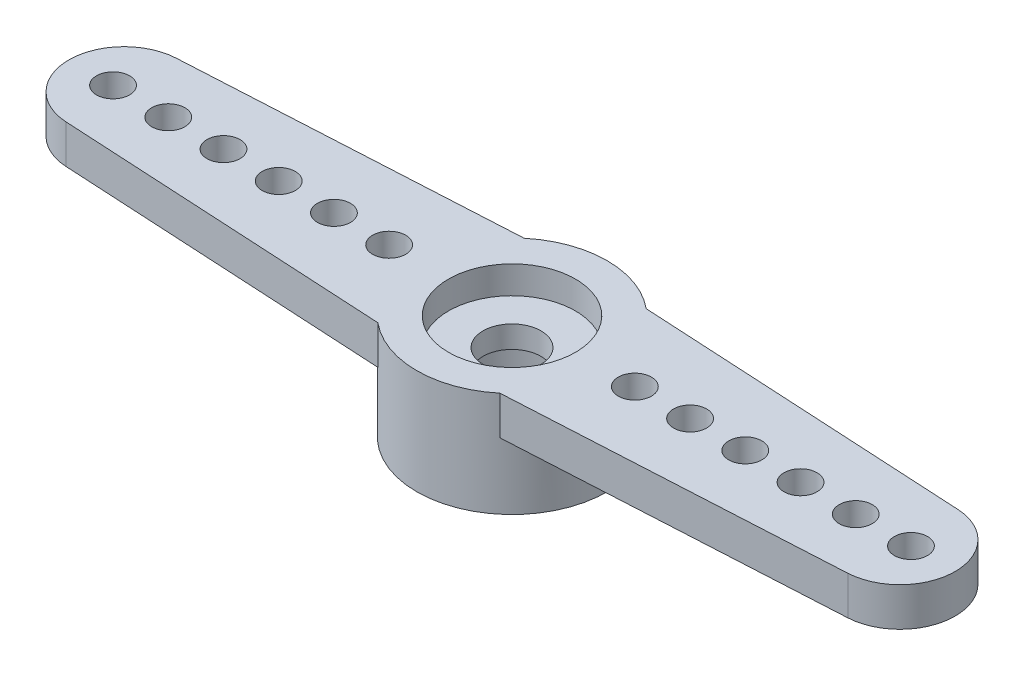
ISO-10303-21;
HEADER;
FILE_DESCRIPTION(('STEP AP214'),'2;1');
FILE_NAME('part.step','',(''),(''),'','','');
FILE_SCHEMA(('AUTOMOTIVE_DESIGN { 1 0 10303 214 1 1 1 1 }'));
ENDSEC;
DATA;
#1=APPLICATION_CONTEXT('core data for automotive mechanical design processes');
#2=APPLICATION_PROTOCOL_DEFINITION('international standard','automotive_design',2000,#1);
#3=PRODUCT_CONTEXT('',#1,'mechanical');
#4=PRODUCT('Part','Part','',(#3));
#5=PRODUCT_RELATED_PRODUCT_CATEGORY('part','',(#4));
#6=PRODUCT_DEFINITION_FORMATION('','',#4);
#7=PRODUCT_DEFINITION_CONTEXT('part definition',#1,'design');
#8=PRODUCT_DEFINITION('design','',#6,#7);
#9=PRODUCT_DEFINITION_SHAPE('','',#8);
#10=(LENGTH_UNIT() NAMED_UNIT(*) SI_UNIT(.MILLI.,.METRE.));
#11=(NAMED_UNIT(*) PLANE_ANGLE_UNIT() SI_UNIT($,.RADIAN.));
#12=(NAMED_UNIT(*) SI_UNIT($,.STERADIAN.) SOLID_ANGLE_UNIT());
#13=UNCERTAINTY_MEASURE_WITH_UNIT(LENGTH_MEASURE(1.E-05),#10,'distance_accuracy_value','');
#14=(GEOMETRIC_REPRESENTATION_CONTEXT(3) GLOBAL_UNCERTAINTY_ASSIGNED_CONTEXT((#13)) GLOBAL_UNIT_ASSIGNED_CONTEXT((#10,
#11,#12)) REPRESENTATION_CONTEXT('',''));
#15=CARTESIAN_POINT('',(0.,0.,0.));
#16=DIRECTION('',(0.,0.,1.));
#17=DIRECTION('',(1.,0.,0.));
#18=AXIS2_PLACEMENT_3D('',#15,#16,#17);
#19=CARTESIAN_POINT('',(-4.45,0.,0.));
#20=DIRECTION('',(0.,1.,0.));
#21=DIRECTION('',(0.,0.,1.));
#22=AXIS2_PLACEMENT_3D('',#19,#20,#21);
#23=CYLINDRICAL_SURFACE('',#22,0.600000000000014);
#24=CARTESIAN_POINT('',(-4.45,0.,0.));
#25=DIRECTION('',(0.,1.,0.));
#26=DIRECTION('',(0.,0.,1.));
#27=AXIS2_PLACEMENT_3D('',#24,#25,#26);
#28=CIRCLE('',#27,0.600000000000014);
#29=CARTESIAN_POINT('',(-4.45,0.,0.600000000000014));
#30=VERTEX_POINT('',#29);
#31=EDGE_CURVE('E49',#30,#30,#28,.T.);
#32=ORIENTED_EDGE('',*,*,#31,.T.);
#33=EDGE_LOOP('',(#32));
#34=FACE_BOUND('',#33,.T.);
#35=CARTESIAN_POINT('',(-4.45,-1.4,0.));
#36=DIRECTION('',(0.,1.,0.));
#37=DIRECTION('',(0.,0.,1.));
#38=AXIS2_PLACEMENT_3D('',#35,#36,#37);
#39=CIRCLE('',#38,0.600000000000014);
#40=CARTESIAN_POINT('',(-4.45,-1.4,0.600000000000014));
#41=VERTEX_POINT('',#40);
#42=EDGE_CURVE('E12',#41,#41,#39,.T.);
#43=ORIENTED_EDGE('',*,*,#42,.F.);
#44=EDGE_LOOP('',(#43));
#45=FACE_BOUND('',#44,.T.);
#46=ADVANCED_FACE('F41',(#34,#45),#23,.F.);
#47=CARTESIAN_POINT('',(-6.45,0.,0.));
#48=DIRECTION('',(0.,1.,0.));
#49=DIRECTION('',(0.,0.,1.));
#50=AXIS2_PLACEMENT_3D('',#47,#48,#49);
#51=CYLINDRICAL_SURFACE('',#50,0.600000000000014);
#52=CARTESIAN_POINT('',(-6.45,0.,0.));
#53=DIRECTION('',(0.,1.,0.));
#54=DIRECTION('',(0.,0.,1.));
#55=AXIS2_PLACEMENT_3D('',#52,#53,#54);
#56=CIRCLE('',#55,0.600000000000014);
#57=CARTESIAN_POINT('',(-6.45,0.,0.600000000000014));
#58=VERTEX_POINT('',#57);
#59=EDGE_CURVE('E268',#58,#58,#56,.T.);
#60=ORIENTED_EDGE('',*,*,#59,.T.);
#61=EDGE_LOOP('',(#60));
#62=FACE_BOUND('',#61,.T.);
#63=CARTESIAN_POINT('',(-6.45,-1.4,0.));
#64=DIRECTION('',(0.,1.,0.));
#65=DIRECTION('',(0.,0.,1.));
#66=AXIS2_PLACEMENT_3D('',#63,#64,#65);
#67=CIRCLE('',#66,0.600000000000014);
#68=CARTESIAN_POINT('',(-6.45,-1.4,0.600000000000014));
#69=VERTEX_POINT('',#68);
#70=EDGE_CURVE('E271',#69,#69,#67,.T.);
#71=ORIENTED_EDGE('',*,*,#70,.F.);
#72=EDGE_LOOP('',(#71));
#73=FACE_BOUND('',#72,.T.);
#74=ADVANCED_FACE('F300',(#62,#73),#51,.F.);
#75=CARTESIAN_POINT('',(-8.45,0.,0.));
#76=DIRECTION('',(0.,1.,0.));
#77=DIRECTION('',(0.,0.,1.));
#78=AXIS2_PLACEMENT_3D('',#75,#76,#77);
#79=CYLINDRICAL_SURFACE('',#78,0.600000000000014);
#80=CARTESIAN_POINT('',(-8.45,0.,0.));
#81=DIRECTION('',(0.,1.,0.));
#82=DIRECTION('',(0.,0.,1.));
#83=AXIS2_PLACEMENT_3D('',#80,#81,#82);
#84=CIRCLE('',#83,0.600000000000014);
#85=CARTESIAN_POINT('',(-8.45,0.,0.600000000000014));
#86=VERTEX_POINT('',#85);
#87=EDGE_CURVE('E262',#86,#86,#84,.T.);
#88=ORIENTED_EDGE('',*,*,#87,.T.);
#89=EDGE_LOOP('',(#88));
#90=FACE_BOUND('',#89,.T.);
#91=CARTESIAN_POINT('',(-8.45,-1.4,0.));
#92=DIRECTION('',(0.,1.,0.));
#93=DIRECTION('',(0.,0.,1.));
#94=AXIS2_PLACEMENT_3D('',#91,#92,#93);
#95=CIRCLE('',#94,0.600000000000014);
#96=CARTESIAN_POINT('',(-8.45,-1.4,0.600000000000014));
#97=VERTEX_POINT('',#96);
#98=EDGE_CURVE('E265',#97,#97,#95,.T.);
#99=ORIENTED_EDGE('',*,*,#98,.F.);
#100=EDGE_LOOP('',(#99));
#101=FACE_BOUND('',#100,.T.);
#102=ADVANCED_FACE('F305',(#90,#101),#79,.F.);
#103=CARTESIAN_POINT('',(-10.45,0.,0.));
#104=DIRECTION('',(0.,1.,0.));
#105=DIRECTION('',(0.,0.,1.));
#106=AXIS2_PLACEMENT_3D('',#103,#104,#105);
#107=CYLINDRICAL_SURFACE('',#106,0.600000000000014);
#108=CARTESIAN_POINT('',(-10.45,0.,0.));
#109=DIRECTION('',(0.,1.,0.));
#110=DIRECTION('',(0.,0.,1.));
#111=AXIS2_PLACEMENT_3D('',#108,#109,#110);
#112=CIRCLE('',#111,0.600000000000014);
#113=CARTESIAN_POINT('',(-10.45,0.,0.600000000000014));
#114=VERTEX_POINT('',#113);
#115=EDGE_CURVE('E250',#114,#114,#112,.T.);
#116=ORIENTED_EDGE('',*,*,#115,.T.);
#117=EDGE_LOOP('',(#116));
#118=FACE_BOUND('',#117,.T.);
#119=CARTESIAN_POINT('',(-10.45,-1.4,0.));
#120=DIRECTION('',(0.,1.,0.));
#121=DIRECTION('',(0.,0.,1.));
#122=AXIS2_PLACEMENT_3D('',#119,#120,#121);
#123=CIRCLE('',#122,0.600000000000014);
#124=CARTESIAN_POINT('',(-10.45,-1.4,0.600000000000014));
#125=VERTEX_POINT('',#124);
#126=EDGE_CURVE('E259',#125,#125,#123,.T.);
#127=ORIENTED_EDGE('',*,*,#126,.F.);
#128=EDGE_LOOP('',(#127));
#129=FACE_BOUND('',#128,.T.);
#130=ADVANCED_FACE('F314',(#118,#129),#107,.F.);
#131=CARTESIAN_POINT('',(0.,-1.4,0.));
#132=DIRECTION('',(0.,1.,0.));
#133=DIRECTION('',(0.,0.,1.));
#134=AXIS2_PLACEMENT_3D('',#131,#132,#133);
#135=PLANE('',#134);
#136=CARTESIAN_POINT('',(-12.45,-1.4,0.));
#137=DIRECTION('',(0.,1.,0.));
#138=DIRECTION('',(0.,0.,1.));
#139=AXIS2_PLACEMENT_3D('',#136,#137,#138);
#140=CIRCLE('',#139,0.600000000000014);
#141=CARTESIAN_POINT('',(-12.45,-1.4,0.600000000000014));
#142=VERTEX_POINT('',#141);
#143=EDGE_CURVE('E211',#142,#142,#140,.T.);
#144=ORIENTED_EDGE('',*,*,#143,.T.);
#145=EDGE_LOOP('',(#144));
#146=FACE_BOUND('',#145,.T.);
#147=CARTESIAN_POINT('',(-14.45,-1.4,0.));
#148=DIRECTION('',(0.,1.,0.));
#149=DIRECTION('',(0.,0.,1.));
#150=AXIS2_PLACEMENT_3D('',#147,#148,#149);
#151=CIRCLE('',#150,0.600000000000014);
#152=CARTESIAN_POINT('',(-14.45,-1.4,0.600000000000014));
#153=VERTEX_POINT('',#152);
#154=EDGE_CURVE('E217',#153,#153,#151,.T.);
#155=ORIENTED_EDGE('',*,*,#154,.T.);
#156=EDGE_LOOP('',(#155));
#157=FACE_BOUND('',#156,.T.);
#158=CARTESIAN_POINT('',(0.,-1.4,0.));
#159=DIRECTION('',(0.,-1.,0.));
#160=DIRECTION('',(0.,0.,-1.));
#161=AXIS2_PLACEMENT_3D('',#158,#159,#160);
#162=CIRCLE('',#161,3.45);
#163=CARTESIAN_POINT('',(-2.20907220343745,-1.4,2.65));
#164=VERTEX_POINT('',#163);
#165=CARTESIAN_POINT('',(-2.20907220343745,-1.4,-2.65));
#166=VERTEX_POINT('',#165);
#167=EDGE_CURVE('E220',#164,#166,#162,.T.);
#168=ORIENTED_EDGE('',*,*,#167,.F.);
#169=DIRECTION('',(0.998510440144325,0.,0.0545609835210727));
#170=VECTOR('',#169,1.);
#171=CARTESIAN_POINT('',(-2.20907220343745,-1.4,2.65));
#172=LINE('',#171,#170);
#173=CARTESIAN_POINT('',(-14.1591219670421,-1.4,1.99702088028865));
#174=VERTEX_POINT('',#173);
#175=EDGE_CURVE('E233',#174,#164,#172,.T.);
#176=ORIENTED_EDGE('',*,*,#175,.F.);
#177=CARTESIAN_POINT('',(-14.05,-1.4,0.));
#178=DIRECTION('',(0.,1.,0.));
#179=DIRECTION('',(0.,0.,1.));
#180=AXIS2_PLACEMENT_3D('',#177,#178,#179);
#181=CIRCLE('',#180,2.);
#182=CARTESIAN_POINT('',(-14.1591219670421,-1.4,-1.99702088028865));
#183=VERTEX_POINT('',#182);
#184=EDGE_CURVE('E229',#183,#174,#181,.T.);
#185=ORIENTED_EDGE('',*,*,#184,.F.);
#186=DIRECTION('',(-0.998510440144325,0.,0.0545609835210729));
#187=VECTOR('',#186,1.);
#188=CARTESIAN_POINT('',(-14.1591219670421,-1.4,-1.99702088028865));
#189=LINE('',#188,#187);
#190=EDGE_CURVE('E226',#166,#183,#189,.T.);
#191=ORIENTED_EDGE('',*,*,#190,.F.);
#192=EDGE_LOOP('',(#168,#176,#185,#191));
#193=FACE_BOUND('',#192,.T.);
#194=ORIENTED_EDGE('',*,*,#126,.T.);
#195=EDGE_LOOP('',(#194));
#196=FACE_BOUND('',#195,.T.);
#197=ORIENTED_EDGE('',*,*,#98,.T.);
#198=EDGE_LOOP('',(#197));
#199=FACE_BOUND('',#198,.T.);
#200=ORIENTED_EDGE('',*,*,#70,.T.);
#201=EDGE_LOOP('',(#200));
#202=FACE_BOUND('',#201,.T.);
#203=ORIENTED_EDGE('',*,*,#42,.T.);
#204=EDGE_LOOP('',(#203));
#205=FACE_BOUND('',#204,.T.);
#206=ADVANCED_FACE('F311',(#146,#157,#193,#196,#199,#202,#205),#135,.F.);
#207=CARTESIAN_POINT('',(0.,-1.4,0.));
#208=DIRECTION('',(0.,1.,0.));
#209=DIRECTION('',(0.,0.,1.));
#210=AXIS2_PLACEMENT_3D('',#207,#208,#209);
#211=CYLINDRICAL_SURFACE('',#210,3.45);
#212=DIRECTION('',(0.,1.,0.));
#213=VECTOR('',#212,1.);
#214=CARTESIAN_POINT('',(-2.20907220343745,-1.4,2.65));
#215=LINE('',#214,#213);
#216=CARTESIAN_POINT('',(-2.20907220343745,0.,2.65));
#217=VERTEX_POINT('',#216);
#218=EDGE_CURVE('E248',#164,#217,#215,.T.);
#219=ORIENTED_EDGE('',*,*,#218,.F.);
#220=ORIENTED_EDGE('',*,*,#167,.T.);
#221=DIRECTION('',(0.,1.,0.));
#222=VECTOR('',#221,1.);
#223=CARTESIAN_POINT('',(-2.20907220343745,-1.4,-2.65));
#224=LINE('',#223,#222);
#225=CARTESIAN_POINT('',(-2.20907220343745,0.,-2.65));
#226=VERTEX_POINT('',#225);
#227=EDGE_CURVE('E236',#166,#226,#224,.T.);
#228=ORIENTED_EDGE('',*,*,#227,.T.);
#229=CARTESIAN_POINT('',(0.,0.,0.));
#230=DIRECTION('',(0.,1.,0.));
#231=DIRECTION('',(0.,0.,1.));
#232=AXIS2_PLACEMENT_3D('',#229,#230,#231);
#233=CIRCLE('',#232,3.45);
#234=CARTESIAN_POINT('',(2.20907220343745,0.,-2.65));
#235=VERTEX_POINT('',#234);
#236=EDGE_CURVE('E225',#235,#226,#233,.T.);
#237=ORIENTED_EDGE('',*,*,#236,.F.);
#238=DIRECTION('',(0.,1.,0.));
#239=VECTOR('',#238,1.);
#240=CARTESIAN_POINT('',(2.20907220343745,-1.4,-2.65));
#241=LINE('',#240,#239);
#242=CARTESIAN_POINT('',(2.20907220343745,-1.4,-2.65));
#243=VERTEX_POINT('',#242);
#244=EDGE_CURVE('E197',#243,#235,#241,.T.);
#245=ORIENTED_EDGE('',*,*,#244,.F.);
#246=CARTESIAN_POINT('',(0.,-1.4,0.));
#247=DIRECTION('',(0.,1.,0.));
#248=DIRECTION('',(0.,0.,1.));
#249=AXIS2_PLACEMENT_3D('',#246,#247,#248);
#250=CIRCLE('',#249,3.45);
#251=CARTESIAN_POINT('',(2.20907220343745,-1.4,2.65));
#252=VERTEX_POINT('',#251);
#253=EDGE_CURVE('E199',#243,#252,#250,.F.);
#254=ORIENTED_EDGE('',*,*,#253,.T.);
#255=DIRECTION('',(0.,1.,0.));
#256=VECTOR('',#255,1.);
#257=CARTESIAN_POINT('',(2.20907220343745,-1.4,2.65));
#258=LINE('',#257,#256);
#259=CARTESIAN_POINT('',(2.20907220343745,0.,2.65));
#260=VERTEX_POINT('',#259);
#261=EDGE_CURVE('E191',#252,#260,#258,.T.);
#262=ORIENTED_EDGE('',*,*,#261,.T.);
#263=EDGE_CURVE('E237',#217,#260,#233,.T.);
#264=ORIENTED_EDGE('',*,*,#263,.F.);
#265=EDGE_LOOP('',(#219,#220,#228,#237,#245,#254,#262,#264));
#266=FACE_BOUND('',#265,.T.);
#267=CARTESIAN_POINT('',(0.,-3.8,0.));
#268=DIRECTION('',(0.,1.,0.));
#269=DIRECTION('',(0.,0.,1.));
#270=AXIS2_PLACEMENT_3D('',#267,#268,#269);
#271=CIRCLE('',#270,3.45);
#272=CARTESIAN_POINT('',(0.,-3.8,3.45));
#273=VERTEX_POINT('',#272);
#274=EDGE_CURVE('E222',#273,#273,#271,.T.);
#275=ORIENTED_EDGE('',*,*,#274,.T.);
#276=EDGE_LOOP('',(#275));
#277=FACE_BOUND('',#276,.T.);
#278=ADVANCED_FACE('F313',(#266,#277),#211,.T.);
#279=CARTESIAN_POINT('',(-2.20907220343745,-1.4,2.65));
#280=DIRECTION('',(-0.0545609835210727,0.,0.998510440144325));
#281=DIRECTION('',(0.998510440144325,0.,0.0545609835210727));
#282=AXIS2_PLACEMENT_3D('',#279,#280,#281);
#283=PLANE('',#282);
#284=DIRECTION('',(0.998510440144325,0.,0.0545609835210727));
#285=VECTOR('',#284,1.);
#286=CARTESIAN_POINT('',(-2.20907220343745,0.,2.65));
#287=LINE('',#286,#285);
#288=CARTESIAN_POINT('',(-14.1591219670421,0.,1.99702088028865));
#289=VERTEX_POINT('',#288);
#290=EDGE_CURVE('E230',#289,#217,#287,.T.);
#291=ORIENTED_EDGE('',*,*,#290,.F.);
#292=DIRECTION('',(0.,1.,0.));
#293=VECTOR('',#292,1.);
#294=CARTESIAN_POINT('',(-14.1591219670421,-1.4,1.99702088028865));
#295=LINE('',#294,#293);
#296=EDGE_CURVE('E251',#174,#289,#295,.T.);
#297=ORIENTED_EDGE('',*,*,#296,.F.);
#298=ORIENTED_EDGE('',*,*,#175,.T.);
#299=ORIENTED_EDGE('',*,*,#218,.T.);
#300=EDGE_LOOP('',(#291,#297,#298,#299));
#301=FACE_BOUND('',#300,.T.);
#302=ADVANCED_FACE('F321',(#301),#283,.T.);
#303=CARTESIAN_POINT('',(-14.05,-1.4,0.));
#304=DIRECTION('',(0.,1.,0.));
#305=DIRECTION('',(0.,0.,1.));
#306=AXIS2_PLACEMENT_3D('',#303,#304,#305);
#307=CYLINDRICAL_SURFACE('',#306,2.);
#308=CARTESIAN_POINT('',(-14.05,0.,0.));
#309=DIRECTION('',(0.,1.,0.));
#310=DIRECTION('',(0.,0.,1.));
#311=AXIS2_PLACEMENT_3D('',#308,#309,#310);
#312=CIRCLE('',#311,2.);
#313=CARTESIAN_POINT('',(-14.1591219670421,0.,-1.99702088028865));
#314=VERTEX_POINT('',#313);
#315=EDGE_CURVE('E243',#314,#289,#312,.T.);
#316=ORIENTED_EDGE('',*,*,#315,.F.);
#317=DIRECTION('',(0.,1.,0.));
#318=VECTOR('',#317,1.);
#319=CARTESIAN_POINT('',(-14.1591219670421,-1.4,-1.99702088028865));
#320=LINE('',#319,#318);
#321=EDGE_CURVE('E253',#183,#314,#320,.T.);
#322=ORIENTED_EDGE('',*,*,#321,.F.);
#323=ORIENTED_EDGE('',*,*,#184,.T.);
#324=ORIENTED_EDGE('',*,*,#296,.T.);
#325=EDGE_LOOP('',(#316,#322,#323,#324));
#326=FACE_BOUND('',#325,.T.);
#327=ADVANCED_FACE('F338',(#326),#307,.T.);
#328=CARTESIAN_POINT('',(-14.1591219670421,-1.4,-1.99702088028865));
#329=DIRECTION('',(-0.0545609835210729,0.,-0.998510440144325));
#330=DIRECTION('',(-0.998510440144325,0.,0.0545609835210729));
#331=AXIS2_PLACEMENT_3D('',#328,#329,#330);
#332=PLANE('',#331);
#333=DIRECTION('',(-0.998510440144325,0.,0.0545609835210729));
#334=VECTOR('',#333,1.);
#335=CARTESIAN_POINT('',(-14.1591219670421,0.,-1.99702088028865));
#336=LINE('',#335,#334);
#337=EDGE_CURVE('E240',#226,#314,#336,.T.);
#338=ORIENTED_EDGE('',*,*,#337,.F.);
#339=ORIENTED_EDGE('',*,*,#227,.F.);
#340=ORIENTED_EDGE('',*,*,#190,.T.);
#341=ORIENTED_EDGE('',*,*,#321,.T.);
#342=EDGE_LOOP('',(#338,#339,#340,#341));
#343=FACE_BOUND('',#342,.T.);
#344=ADVANCED_FACE('F334',(#343),#332,.T.);
#345=CARTESIAN_POINT('',(0.,0.,0.));
#346=DIRECTION('',(0.,1.,0.));
#347=DIRECTION('',(0.,0.,1.));
#348=AXIS2_PLACEMENT_3D('',#345,#346,#347);
#349=PLANE('',#348);
#350=CARTESIAN_POINT('',(0.,0.,0.));
#351=DIRECTION('',(0.,1.,0.));
#352=DIRECTION('',(0.,0.,1.));
#353=AXIS2_PLACEMENT_3D('',#350,#351,#352);
#354=CIRCLE('',#353,2.30000000000001);
#355=CARTESIAN_POINT('',(0.,0.,2.30000000000001));
#356=VERTEX_POINT('',#355);
#357=EDGE_CURVE('E702',#356,#356,#354,.T.);
#358=ORIENTED_EDGE('',*,*,#357,.F.);
#359=EDGE_LOOP('',(#358));
#360=FACE_BOUND('',#359,.T.);
#361=CARTESIAN_POINT('',(4.45,0.,0.));
#362=DIRECTION('',(0.,1.,0.));
#363=DIRECTION('',(0.,0.,1.));
#364=AXIS2_PLACEMENT_3D('',#361,#362,#363);
#365=CIRCLE('',#364,0.600000000000014);
#366=CARTESIAN_POINT('',(4.45,0.,0.600000000000014));
#367=VERTEX_POINT('',#366);
#368=EDGE_CURVE('E145',#367,#367,#365,.T.);
#369=ORIENTED_EDGE('',*,*,#368,.F.);
#370=EDGE_LOOP('',(#369));
#371=FACE_BOUND('',#370,.T.);
#372=CARTESIAN_POINT('',(6.45,0.,0.));
#373=DIRECTION('',(0.,1.,0.));
#374=DIRECTION('',(0.,0.,1.));
#375=AXIS2_PLACEMENT_3D('',#372,#373,#374);
#376=CIRCLE('',#375,0.600000000000014);
#377=CARTESIAN_POINT('',(6.45,0.,0.600000000000014));
#378=VERTEX_POINT('',#377);
#379=EDGE_CURVE('E155',#378,#378,#376,.T.);
#380=ORIENTED_EDGE('',*,*,#379,.F.);
#381=EDGE_LOOP('',(#380));
#382=FACE_BOUND('',#381,.T.);
#383=CARTESIAN_POINT('',(8.45,0.,0.));
#384=DIRECTION('',(0.,1.,0.));
#385=DIRECTION('',(0.,0.,1.));
#386=AXIS2_PLACEMENT_3D('',#383,#384,#385);
#387=CIRCLE('',#386,0.600000000000014);
#388=CARTESIAN_POINT('',(8.45,0.,0.600000000000014));
#389=VERTEX_POINT('',#388);
#390=EDGE_CURVE('E159',#389,#389,#387,.T.);
#391=ORIENTED_EDGE('',*,*,#390,.F.);
#392=EDGE_LOOP('',(#391));
#393=FACE_BOUND('',#392,.T.);
#394=CARTESIAN_POINT('',(10.45,0.,0.));
#395=DIRECTION('',(0.,1.,0.));
#396=DIRECTION('',(0.,0.,1.));
#397=AXIS2_PLACEMENT_3D('',#394,#395,#396);
#398=CIRCLE('',#397,0.600000000000014);
#399=CARTESIAN_POINT('',(10.45,0.,0.600000000000014));
#400=VERTEX_POINT('',#399);
#401=EDGE_CURVE('E163',#400,#400,#398,.T.);
#402=ORIENTED_EDGE('',*,*,#401,.F.);
#403=EDGE_LOOP('',(#402));
#404=FACE_BOUND('',#403,.T.);
#405=CARTESIAN_POINT('',(12.45,0.,0.));
#406=DIRECTION('',(0.,1.,0.));
#407=DIRECTION('',(0.,0.,1.));
#408=AXIS2_PLACEMENT_3D('',#405,#406,#407);
#409=CIRCLE('',#408,0.600000000000014);
#410=CARTESIAN_POINT('',(12.45,0.,0.600000000000014));
#411=VERTEX_POINT('',#410);
#412=EDGE_CURVE('E169',#411,#411,#409,.T.);
#413=ORIENTED_EDGE('',*,*,#412,.F.);
#414=EDGE_LOOP('',(#413));
#415=FACE_BOUND('',#414,.T.);
#416=CARTESIAN_POINT('',(14.45,0.,0.));
#417=DIRECTION('',(0.,1.,0.));
#418=DIRECTION('',(0.,0.,1.));
#419=AXIS2_PLACEMENT_3D('',#416,#417,#418);
#420=CIRCLE('',#419,0.600000000000014);
#421=CARTESIAN_POINT('',(14.45,0.,0.600000000000014));
#422=VERTEX_POINT('',#421);
#423=EDGE_CURVE('E175',#422,#422,#420,.T.);
#424=ORIENTED_EDGE('',*,*,#423,.F.);
#425=EDGE_LOOP('',(#424));
#426=FACE_BOUND('',#425,.T.);
#427=ORIENTED_EDGE('',*,*,#290,.T.);
#428=ORIENTED_EDGE('',*,*,#263,.T.);
#429=DIRECTION('',(0.998510440144325,0.,-0.0545609835210729));
#430=VECTOR('',#429,1.);
#431=CARTESIAN_POINT('',(14.1591219670421,0.,1.99702088028865));
#432=LINE('',#431,#430);
#433=CARTESIAN_POINT('',(14.1591219670421,0.,1.99702088028865));
#434=VERTEX_POINT('',#433);
#435=EDGE_CURVE('E181',#260,#434,#432,.T.);
#436=ORIENTED_EDGE('',*,*,#435,.T.);
#437=CARTESIAN_POINT('',(14.05,0.,0.));
#438=DIRECTION('',(0.,1.,0.));
#439=DIRECTION('',(0.,0.,-1.));
#440=AXIS2_PLACEMENT_3D('',#437,#438,#439);
#441=CIRCLE('',#440,2.);
#442=CARTESIAN_POINT('',(14.1591219670421,0.,-1.99702088028865));
#443=VERTEX_POINT('',#442);
#444=EDGE_CURVE('E194',#434,#443,#441,.T.);
#445=ORIENTED_EDGE('',*,*,#444,.T.);
#446=DIRECTION('',(-0.998510440144325,0.,-0.0545609835210727));
#447=VECTOR('',#446,1.);
#448=CARTESIAN_POINT('',(2.20907220343745,0.,-2.65));
#449=LINE('',#448,#447);
#450=EDGE_CURVE('E65',#443,#235,#449,.T.);
#451=ORIENTED_EDGE('',*,*,#450,.T.);
#452=ORIENTED_EDGE('',*,*,#236,.T.);
#453=ORIENTED_EDGE('',*,*,#337,.T.);
#454=ORIENTED_EDGE('',*,*,#315,.T.);
#455=EDGE_LOOP('',(#427,#428,#436,#445,#451,#452,#453,#454));
#456=FACE_BOUND('',#455,.T.);
#457=CARTESIAN_POINT('',(-12.45,0.,0.));
#458=DIRECTION('',(0.,1.,0.));
#459=DIRECTION('',(0.,0.,1.));
#460=AXIS2_PLACEMENT_3D('',#457,#458,#459);
#461=CIRCLE('',#460,0.600000000000014);
#462=CARTESIAN_POINT('',(-12.45,0.,0.600000000000014));
#463=VERTEX_POINT('',#462);
#464=EDGE_CURVE('E208',#463,#463,#461,.T.);
#465=ORIENTED_EDGE('',*,*,#464,.F.);
#466=EDGE_LOOP('',(#465));
#467=FACE_BOUND('',#466,.T.);
#468=CARTESIAN_POINT('',(-14.45,0.,0.));
#469=DIRECTION('',(0.,1.,0.));
#470=DIRECTION('',(0.,0.,1.));
#471=AXIS2_PLACEMENT_3D('',#468,#469,#470);
#472=CIRCLE('',#471,0.600000000000014);
#473=CARTESIAN_POINT('',(-14.45,0.,0.600000000000014));
#474=VERTEX_POINT('',#473);
#475=EDGE_CURVE('E214',#474,#474,#472,.T.);
#476=ORIENTED_EDGE('',*,*,#475,.F.);
#477=EDGE_LOOP('',(#476));
#478=FACE_BOUND('',#477,.T.);
#479=ORIENTED_EDGE('',*,*,#115,.F.);
#480=EDGE_LOOP('',(#479));
#481=FACE_BOUND('',#480,.T.);
#482=ORIENTED_EDGE('',*,*,#87,.F.);
#483=EDGE_LOOP('',(#482));
#484=FACE_BOUND('',#483,.T.);
#485=ORIENTED_EDGE('',*,*,#59,.F.);
#486=EDGE_LOOP('',(#485));
#487=FACE_BOUND('',#486,.T.);
#488=ORIENTED_EDGE('',*,*,#31,.F.);
#489=EDGE_LOOP('',(#488));
#490=FACE_BOUND('',#489,.T.);
#491=ADVANCED_FACE('F331',(#360,#371,#382,#393,#404,#415,#426,#456,#467,#478,#481,#484,#487,
#490),#349,.T.);
#492=CARTESIAN_POINT('',(0.,-3.8,0.));
#493=DIRECTION('',(0.,1.,0.));
#494=DIRECTION('',(0.,0.,1.));
#495=AXIS2_PLACEMENT_3D('',#492,#493,#494);
#496=PLANE('',#495);
#497=CARTESIAN_POINT('',(0.,-3.8,0.));
#498=DIRECTION('',(0.,-1.,0.));
#499=DIRECTION('',(0.,0.,-1.));
#500=AXIS2_PLACEMENT_3D('',#497,#498,#499);
#501=CIRCLE('',#500,2.47500000000001);
#502=CARTESIAN_POINT('',(-0.0980567859880787,-3.8,2.47305678598809));
#503=VERTEX_POINT('',#502);
#504=CARTESIAN_POINT('',(0.0980567859880785,-3.8,2.47305678598809));
#505=VERTEX_POINT('',#504);
#506=EDGE_CURVE('E146',#503,#505,#501,.T.);
#507=ORIENTED_EDGE('',*,*,#506,.F.);
#508=DIRECTION('',(0.707106781186545,0.,-0.70710678118655));
#509=VECTOR('',#508,1.);
#510=CARTESIAN_POINT('',(-0.0980567859880787,-3.8,2.47305678598809));
#511=LINE('',#510,#509);
#512=CARTESIAN_POINT('',(0.,-3.8,2.37500000000001));
#513=VERTEX_POINT('',#512);
#514=EDGE_CURVE('E131',#503,#513,#511,.T.);
#515=ORIENTED_EDGE('',*,*,#514,.T.);
#516=DIRECTION('',(0.707106781186545,0.,0.70710678118655));
#517=VECTOR('',#516,1.);
#518=CARTESIAN_POINT('',(0.,-3.8,2.37500000000001));
#519=LINE('',#518,#517);
#520=EDGE_CURVE('E694',#513,#505,#519,.T.);
#521=ORIENTED_EDGE('',*,*,#520,.T.);
#522=EDGE_LOOP('',(#507,#515,#521));
#523=FACE_BOUND('',#522,.T.);
#524=ORIENTED_EDGE('',*,*,#274,.F.);
#525=EDGE_LOOP('',(#524));
#526=FACE_BOUND('',#525,.T.);
#527=ADVANCED_FACE('F329',(#523,#526),#496,.F.);
#528=CARTESIAN_POINT('',(-14.45,0.,0.));
#529=DIRECTION('',(0.,1.,0.));
#530=DIRECTION('',(0.,0.,1.));
#531=AXIS2_PLACEMENT_3D('',#528,#529,#530);
#532=CYLINDRICAL_SURFACE('',#531,0.600000000000014);
#533=ORIENTED_EDGE('',*,*,#475,.T.);
#534=EDGE_LOOP('',(#533));
#535=FACE_BOUND('',#534,.T.);
#536=ORIENTED_EDGE('',*,*,#154,.F.);
#537=EDGE_LOOP('',(#536));
#538=FACE_BOUND('',#537,.T.);
#539=ADVANCED_FACE('F385',(#535,#538),#532,.F.);
#540=CARTESIAN_POINT('',(-12.45,0.,0.));
#541=DIRECTION('',(0.,1.,0.));
#542=DIRECTION('',(0.,0.,1.));
#543=AXIS2_PLACEMENT_3D('',#540,#541,#542);
#544=CYLINDRICAL_SURFACE('',#543,0.600000000000014);
#545=ORIENTED_EDGE('',*,*,#464,.T.);
#546=EDGE_LOOP('',(#545));
#547=FACE_BOUND('',#546,.T.);
#548=ORIENTED_EDGE('',*,*,#143,.F.);
#549=EDGE_LOOP('',(#548));
#550=FACE_BOUND('',#549,.T.);
#551=ADVANCED_FACE('F380',(#547,#550),#544,.F.);
#552=CARTESIAN_POINT('',(2.20907220343745,-1.4,-2.65));
#553=DIRECTION('',(0.0545609835210727,0.,-0.998510440144325));
#554=DIRECTION('',(-0.998510440144325,0.,-0.0545609835210727));
#555=AXIS2_PLACEMENT_3D('',#552,#553,#554);
#556=PLANE('',#555);
#557=ORIENTED_EDGE('',*,*,#450,.F.);
#558=DIRECTION('',(0.,1.,0.));
#559=VECTOR('',#558,1.);
#560=CARTESIAN_POINT('',(14.1591219670421,-1.4,-1.99702088028865));
#561=LINE('',#560,#559);
#562=CARTESIAN_POINT('',(14.1591219670421,-1.4,-1.99702088028865));
#563=VERTEX_POINT('',#562);
#564=EDGE_CURVE('E200',#563,#443,#561,.T.);
#565=ORIENTED_EDGE('',*,*,#564,.F.);
#566=DIRECTION('',(-0.998510440144325,0.,-0.0545609835210727));
#567=VECTOR('',#566,1.);
#568=CARTESIAN_POINT('',(2.20907220343745,-1.4,-2.65));
#569=LINE('',#568,#567);
#570=EDGE_CURVE('E188',#563,#243,#569,.T.);
#571=ORIENTED_EDGE('',*,*,#570,.T.);
#572=ORIENTED_EDGE('',*,*,#244,.T.);
#573=EDGE_LOOP('',(#557,#565,#571,#572));
#574=FACE_BOUND('',#573,.T.);
#575=ADVANCED_FACE('F384',(#574),#556,.T.);
#576=CARTESIAN_POINT('',(14.05,-1.4,0.));
#577=DIRECTION('',(0.,1.,0.));
#578=DIRECTION('',(0.,0.,1.));
#579=AXIS2_PLACEMENT_3D('',#576,#577,#578);
#580=CYLINDRICAL_SURFACE('',#579,2.);
#581=ORIENTED_EDGE('',*,*,#444,.F.);
#582=DIRECTION('',(0.,1.,0.));
#583=VECTOR('',#582,1.);
#584=CARTESIAN_POINT('',(14.1591219670421,-1.4,1.99702088028865));
#585=LINE('',#584,#583);
#586=CARTESIAN_POINT('',(14.1591219670421,-1.4,1.99702088028865));
#587=VERTEX_POINT('',#586);
#588=EDGE_CURVE('E202',#587,#434,#585,.T.);
#589=ORIENTED_EDGE('',*,*,#588,.F.);
#590=CARTESIAN_POINT('',(14.05,-1.4,0.));
#591=DIRECTION('',(0.,1.,0.));
#592=DIRECTION('',(0.,0.,-1.));
#593=AXIS2_PLACEMENT_3D('',#590,#591,#592);
#594=CIRCLE('',#593,2.);
#595=EDGE_CURVE('E185',#587,#563,#594,.T.);
#596=ORIENTED_EDGE('',*,*,#595,.T.);
#597=ORIENTED_EDGE('',*,*,#564,.T.);
#598=EDGE_LOOP('',(#581,#589,#596,#597));
#599=FACE_BOUND('',#598,.T.);
#600=ADVANCED_FACE('F406',(#599),#580,.T.);
#601=CARTESIAN_POINT('',(14.1591219670421,-1.4,1.99702088028865));
#602=DIRECTION('',(0.0545609835210729,0.,0.998510440144325));
#603=DIRECTION('',(0.998510440144325,0.,-0.0545609835210729));
#604=AXIS2_PLACEMENT_3D('',#601,#602,#603);
#605=PLANE('',#604);
#606=ORIENTED_EDGE('',*,*,#435,.F.);
#607=ORIENTED_EDGE('',*,*,#261,.F.);
#608=DIRECTION('',(0.998510440144325,0.,-0.0545609835210729));
#609=VECTOR('',#608,1.);
#610=CARTESIAN_POINT('',(14.1591219670421,-1.4,1.99702088028865));
#611=LINE('',#610,#609);
#612=EDGE_CURVE('E182',#252,#587,#611,.T.);
#613=ORIENTED_EDGE('',*,*,#612,.T.);
#614=ORIENTED_EDGE('',*,*,#588,.T.);
#615=EDGE_LOOP('',(#606,#607,#613,#614));
#616=FACE_BOUND('',#615,.T.);
#617=ADVANCED_FACE('F417',(#616),#605,.T.);
#618=CARTESIAN_POINT('',(0.,-1.4,0.));
#619=DIRECTION('',(0.,1.,0.));
#620=DIRECTION('',(0.,0.,-1.));
#621=AXIS2_PLACEMENT_3D('',#618,#619,#620);
#622=PLANE('',#621);
#623=CARTESIAN_POINT('',(4.45,-1.4,0.));
#624=DIRECTION('',(0.,1.,0.));
#625=DIRECTION('',(0.,0.,1.));
#626=AXIS2_PLACEMENT_3D('',#623,#624,#625);
#627=CIRCLE('',#626,0.600000000000013);
#628=CARTESIAN_POINT('',(4.45,-1.4,0.600000000000013));
#629=VERTEX_POINT('',#628);
#630=EDGE_CURVE('E149',#629,#629,#627,.T.);
#631=ORIENTED_EDGE('',*,*,#630,.T.);
#632=EDGE_LOOP('',(#631));
#633=FACE_BOUND('',#632,.T.);
#634=CARTESIAN_POINT('',(6.45,-1.4,0.));
#635=DIRECTION('',(0.,1.,0.));
#636=DIRECTION('',(0.,0.,1.));
#637=AXIS2_PLACEMENT_3D('',#634,#635,#636);
#638=CIRCLE('',#637,0.600000000000013);
#639=CARTESIAN_POINT('',(6.45,-1.4,0.600000000000013));
#640=VERTEX_POINT('',#639);
#641=EDGE_CURVE('E158',#640,#640,#638,.T.);
#642=ORIENTED_EDGE('',*,*,#641,.T.);
#643=EDGE_LOOP('',(#642));
#644=FACE_BOUND('',#643,.T.);
#645=CARTESIAN_POINT('',(8.45,-1.4,0.));
#646=DIRECTION('',(0.,1.,0.));
#647=DIRECTION('',(0.,0.,1.));
#648=AXIS2_PLACEMENT_3D('',#645,#646,#647);
#649=CIRCLE('',#648,0.600000000000014);
#650=CARTESIAN_POINT('',(8.45,-1.4,0.600000000000014));
#651=VERTEX_POINT('',#650);
#652=EDGE_CURVE('E162',#651,#651,#649,.T.);
#653=ORIENTED_EDGE('',*,*,#652,.T.);
#654=EDGE_LOOP('',(#653));
#655=FACE_BOUND('',#654,.T.);
#656=CARTESIAN_POINT('',(10.45,-1.4,0.));
#657=DIRECTION('',(0.,1.,0.));
#658=DIRECTION('',(0.,0.,1.));
#659=AXIS2_PLACEMENT_3D('',#656,#657,#658);
#660=CIRCLE('',#659,0.600000000000014);
#661=CARTESIAN_POINT('',(10.45,-1.4,0.600000000000014));
#662=VERTEX_POINT('',#661);
#663=EDGE_CURVE('E166',#662,#662,#660,.T.);
#664=ORIENTED_EDGE('',*,*,#663,.T.);
#665=EDGE_LOOP('',(#664));
#666=FACE_BOUND('',#665,.T.);
#667=CARTESIAN_POINT('',(12.45,-1.4,0.));
#668=DIRECTION('',(0.,1.,0.));
#669=DIRECTION('',(0.,0.,1.));
#670=AXIS2_PLACEMENT_3D('',#667,#668,#669);
#671=CIRCLE('',#670,0.600000000000014);
#672=CARTESIAN_POINT('',(12.45,-1.4,0.600000000000014));
#673=VERTEX_POINT('',#672);
#674=EDGE_CURVE('E172',#673,#673,#671,.T.);
#675=ORIENTED_EDGE('',*,*,#674,.T.);
#676=EDGE_LOOP('',(#675));
#677=FACE_BOUND('',#676,.T.);
#678=CARTESIAN_POINT('',(14.45,-1.4,0.));
#679=DIRECTION('',(0.,1.,0.));
#680=DIRECTION('',(0.,0.,1.));
#681=AXIS2_PLACEMENT_3D('',#678,#679,#680);
#682=CIRCLE('',#681,0.600000000000014);
#683=CARTESIAN_POINT('',(14.45,-1.4,0.600000000000014));
#684=VERTEX_POINT('',#683);
#685=EDGE_CURVE('E178',#684,#684,#682,.T.);
#686=ORIENTED_EDGE('',*,*,#685,.T.);
#687=EDGE_LOOP('',(#686));
#688=FACE_BOUND('',#687,.T.);
#689=ORIENTED_EDGE('',*,*,#253,.F.);
#690=ORIENTED_EDGE('',*,*,#570,.F.);
#691=ORIENTED_EDGE('',*,*,#595,.F.);
#692=ORIENTED_EDGE('',*,*,#612,.F.);
#693=EDGE_LOOP('',(#689,#690,#691,#692));
#694=FACE_BOUND('',#693,.T.);
#695=ADVANCED_FACE('F282',(#633,#644,#655,#666,#677,#688,#694),#622,.F.);
#696=CARTESIAN_POINT('',(14.45,0.,0.));
#697=DIRECTION('',(0.,1.,0.));
#698=DIRECTION('',(0.,0.,1.));
#699=AXIS2_PLACEMENT_3D('',#696,#697,#698);
#700=CYLINDRICAL_SURFACE('',#699,0.600000000000014);
#701=ORIENTED_EDGE('',*,*,#423,.T.);
#702=EDGE_LOOP('',(#701));
#703=FACE_BOUND('',#702,.T.);
#704=ORIENTED_EDGE('',*,*,#685,.F.);
#705=EDGE_LOOP('',(#704));
#706=FACE_BOUND('',#705,.T.);
#707=ADVANCED_FACE('F438',(#703,#706),#700,.F.);
#708=CARTESIAN_POINT('',(12.45,0.,0.));
#709=DIRECTION('',(0.,1.,0.));
#710=DIRECTION('',(0.,0.,1.));
#711=AXIS2_PLACEMENT_3D('',#708,#709,#710);
#712=CYLINDRICAL_SURFACE('',#711,0.600000000000014);
#713=ORIENTED_EDGE('',*,*,#412,.T.);
#714=EDGE_LOOP('',(#713));
#715=FACE_BOUND('',#714,.T.);
#716=ORIENTED_EDGE('',*,*,#674,.F.);
#717=EDGE_LOOP('',(#716));
#718=FACE_BOUND('',#717,.T.);
#719=ADVANCED_FACE('F448',(#715,#718),#712,.F.);
#720=CARTESIAN_POINT('',(10.45,0.,0.));
#721=DIRECTION('',(0.,1.,0.));
#722=DIRECTION('',(0.,0.,1.));
#723=AXIS2_PLACEMENT_3D('',#720,#721,#722);
#724=CYLINDRICAL_SURFACE('',#723,0.600000000000014);
#725=ORIENTED_EDGE('',*,*,#401,.T.);
#726=EDGE_LOOP('',(#725));
#727=FACE_BOUND('',#726,.T.);
#728=ORIENTED_EDGE('',*,*,#663,.F.);
#729=EDGE_LOOP('',(#728));
#730=FACE_BOUND('',#729,.T.);
#731=ADVANCED_FACE('F459',(#727,#730),#724,.F.);
#732=CARTESIAN_POINT('',(8.45,0.,0.));
#733=DIRECTION('',(0.,1.,0.));
#734=DIRECTION('',(0.,0.,1.));
#735=AXIS2_PLACEMENT_3D('',#732,#733,#734);
#736=CYLINDRICAL_SURFACE('',#735,0.600000000000014);
#737=ORIENTED_EDGE('',*,*,#390,.T.);
#738=EDGE_LOOP('',(#737));
#739=FACE_BOUND('',#738,.T.);
#740=ORIENTED_EDGE('',*,*,#652,.F.);
#741=EDGE_LOOP('',(#740));
#742=FACE_BOUND('',#741,.T.);
#743=ADVANCED_FACE('F296',(#739,#742),#736,.F.);
#744=CARTESIAN_POINT('',(6.45,0.,0.));
#745=DIRECTION('',(0.,1.,0.));
#746=DIRECTION('',(0.,0.,1.));
#747=AXIS2_PLACEMENT_3D('',#744,#745,#746);
#748=CYLINDRICAL_SURFACE('',#747,0.600000000000013);
#749=ORIENTED_EDGE('',*,*,#379,.T.);
#750=EDGE_LOOP('',(#749));
#751=FACE_BOUND('',#750,.T.);
#752=ORIENTED_EDGE('',*,*,#641,.F.);
#753=EDGE_LOOP('',(#752));
#754=FACE_BOUND('',#753,.T.);
#755=ADVANCED_FACE('F287',(#751,#754),#748,.F.);
#756=CARTESIAN_POINT('',(4.45,0.,0.));
#757=DIRECTION('',(0.,1.,0.));
#758=DIRECTION('',(0.,0.,1.));
#759=AXIS2_PLACEMENT_3D('',#756,#757,#758);
#760=CYLINDRICAL_SURFACE('',#759,0.600000000000013);
#761=ORIENTED_EDGE('',*,*,#368,.T.);
#762=EDGE_LOOP('',(#761));
#763=FACE_BOUND('',#762,.T.);
#764=ORIENTED_EDGE('',*,*,#630,.F.);
#765=EDGE_LOOP('',(#764));
#766=FACE_BOUND('',#765,.T.);
#767=ADVANCED_FACE('F285',(#763,#766),#760,.F.);
#768=CARTESIAN_POINT('',(0.,-1.8,0.));
#769=DIRECTION('',(0.,1.,0.));
#770=DIRECTION('',(0.,0.,1.));
#771=AXIS2_PLACEMENT_3D('',#768,#769,#770);
#772=PLANE('',#771);
#773=CARTESIAN_POINT('',(0.,-1.8,0.));
#774=DIRECTION('',(0.,1.,0.));
#775=DIRECTION('',(0.,0.,1.));
#776=AXIS2_PLACEMENT_3D('',#773,#774,#775);
#777=CIRCLE('',#776,1.05000000000001);
#778=CARTESIAN_POINT('',(0.,-1.8,1.05000000000001));
#779=VERTEX_POINT('',#778);
#780=EDGE_CURVE('E44',#779,#779,#777,.T.);
#781=ORIENTED_EDGE('',*,*,#780,.T.);
#782=EDGE_LOOP('',(#781));
#783=FACE_BOUND('',#782,.T.);
#784=DIRECTION('',(0.707106781186545,0.,0.70710678118655));
#785=VECTOR('',#784,1.);
#786=CARTESIAN_POINT('',(0.,-1.8,2.37500000000001));
#787=LINE('',#786,#785);
#788=CARTESIAN_POINT('',(0.,-1.8,2.37500000000001));
#789=VERTEX_POINT('',#788);
#790=CARTESIAN_POINT('',(0.0980567859880785,-1.8,2.47305678598809));
#791=VERTEX_POINT('',#790);
#792=EDGE_CURVE('E57',#789,#791,#787,.T.);
#793=ORIENTED_EDGE('',*,*,#792,.F.);
#794=DIRECTION('',(0.707106781186545,0.,-0.70710678118655));
#795=VECTOR('',#794,1.);
#796=CARTESIAN_POINT('',(-0.0980567859880787,-1.8,2.47305678598809));
#797=LINE('',#796,#795);
#798=CARTESIAN_POINT('',(-0.0980567859880787,-1.8,2.47305678598809));
#799=VERTEX_POINT('',#798);
#800=EDGE_CURVE('E129',#799,#789,#797,.T.);
#801=ORIENTED_EDGE('',*,*,#800,.F.);
#802=CARTESIAN_POINT('',(0.,-1.8,0.));
#803=DIRECTION('',(0.,-1.,0.));
#804=DIRECTION('',(0.,0.,-1.));
#805=AXIS2_PLACEMENT_3D('',#802,#803,#804);
#806=CIRCLE('',#805,2.47500000000001);
#807=EDGE_CURVE('E140',#799,#791,#806,.T.);
#808=ORIENTED_EDGE('',*,*,#807,.T.);
#809=EDGE_LOOP('',(#793,#801,#808));
#810=FACE_BOUND('',#809,.T.);
#811=ADVANCED_FACE('F139',(#783,#810),#772,.F.);
#812=CARTESIAN_POINT('',(0.,-3.8,0.));
#813=DIRECTION('',(0.,-1.,0.));
#814=DIRECTION('',(0.,0.,-1.));
#815=AXIS2_PLACEMENT_3D('',#812,#813,#814);
#816=CYLINDRICAL_SURFACE('',#815,2.47500000000001);
#817=ORIENTED_EDGE('',*,*,#807,.F.);
#818=DIRECTION('',(0.,-1.,0.));
#819=VECTOR('',#818,1.);
#820=CARTESIAN_POINT('',(-0.0980567859880787,-1.57986246773154,2.47305678598809));
#821=LINE('',#820,#819);
#822=EDGE_CURVE('E126',#799,#503,#821,.T.);
#823=ORIENTED_EDGE('',*,*,#822,.T.);
#824=ORIENTED_EDGE('',*,*,#506,.T.);
#825=DIRECTION('',(0.,-1.,0.));
#826=VECTOR('',#825,1.);
#827=CARTESIAN_POINT('',(0.0980567859880785,-1.57986246773154,2.47305678598809));
#828=LINE('',#827,#826);
#829=EDGE_CURVE('E144',#791,#505,#828,.T.);
#830=ORIENTED_EDGE('',*,*,#829,.F.);
#831=EDGE_LOOP('',(#817,#823,#824,#830));
#832=FACE_BOUND('',#831,.T.);
#833=ADVANCED_FACE('F143',(#832),#816,.F.);
#834=CARTESIAN_POINT('',(0.,-1.,0.));
#835=DIRECTION('',(0.,-1.,0.));
#836=DIRECTION('',(0.,0.,-1.));
#837=AXIS2_PLACEMENT_3D('',#834,#835,#836);
#838=PLANE('',#837);
#839=CARTESIAN_POINT('',(0.,-1.,0.));
#840=DIRECTION('',(0.,-1.,0.));
#841=DIRECTION('',(0.,0.,-1.));
#842=AXIS2_PLACEMENT_3D('',#839,#840,#841);
#843=CIRCLE('',#842,1.05000000000001);
#844=CARTESIAN_POINT('',(0.,-1.,-1.05000000000001));
#845=VERTEX_POINT('',#844);
#846=EDGE_CURVE('E699',#845,#845,#843,.T.);
#847=ORIENTED_EDGE('',*,*,#846,.T.);
#848=EDGE_LOOP('',(#847));
#849=FACE_BOUND('',#848,.T.);
#850=CARTESIAN_POINT('',(0.,-1.,0.));
#851=DIRECTION('',(0.,1.,0.));
#852=DIRECTION('',(0.,0.,1.));
#853=AXIS2_PLACEMENT_3D('',#850,#851,#852);
#854=CIRCLE('',#853,2.30000000000001);
#855=CARTESIAN_POINT('',(0.,-1.,2.30000000000001));
#856=VERTEX_POINT('',#855);
#857=EDGE_CURVE('E151',#856,#856,#854,.T.);
#858=ORIENTED_EDGE('',*,*,#857,.T.);
#859=EDGE_LOOP('',(#858));
#860=FACE_BOUND('',#859,.T.);
#861=ADVANCED_FACE('F512',(#849,#860),#838,.F.);
#862=CARTESIAN_POINT('',(0.,0.,0.));
#863=DIRECTION('',(0.,1.,0.));
#864=DIRECTION('',(0.,0.,1.));
#865=AXIS2_PLACEMENT_3D('',#862,#863,#864);
#866=CYLINDRICAL_SURFACE('',#865,2.30000000000001);
#867=ORIENTED_EDGE('',*,*,#857,.F.);
#868=EDGE_LOOP('',(#867));
#869=FACE_BOUND('',#868,.T.);
#870=ORIENTED_EDGE('',*,*,#357,.T.);
#871=EDGE_LOOP('',(#870));
#872=FACE_BOUND('',#871,.T.);
#873=ADVANCED_FACE('F506',(#869,#872),#866,.F.);
#874=CARTESIAN_POINT('',(0.,0.,0.));
#875=DIRECTION('',(0.,1.,0.));
#876=DIRECTION('',(0.,0.,1.));
#877=AXIS2_PLACEMENT_3D('',#874,#875,#876);
#878=CYLINDRICAL_SURFACE('',#877,1.05000000000001);
#879=ORIENTED_EDGE('',*,*,#780,.F.);
#880=EDGE_LOOP('',(#879));
#881=FACE_BOUND('',#880,.T.);
#882=ORIENTED_EDGE('',*,*,#846,.F.);
#883=EDGE_LOOP('',(#882));
#884=FACE_BOUND('',#883,.T.);
#885=ADVANCED_FACE('F511',(#881,#884),#878,.F.);
#886=CARTESIAN_POINT('',(-0.0980567859880787,-1.57986246773154,2.47305678598809));
#887=DIRECTION('',(-0.70710678118655,0.,-0.707106781186545));
#888=DIRECTION('',(-0.707106781186545,0.,0.70710678118655));
#889=AXIS2_PLACEMENT_3D('',#886,#887,#888);
#890=PLANE('',#889);
#891=ORIENTED_EDGE('',*,*,#822,.F.);
#892=ORIENTED_EDGE('',*,*,#800,.T.);
#893=DIRECTION('',(0.,-1.,0.));
#894=VECTOR('',#893,1.);
#895=CARTESIAN_POINT('',(0.,-1.57986246773154,2.37500000000001));
#896=LINE('',#895,#894);
#897=EDGE_CURVE('E141',#789,#513,#896,.T.);
#898=ORIENTED_EDGE('',*,*,#897,.T.);
#899=ORIENTED_EDGE('',*,*,#514,.F.);
#900=EDGE_LOOP('',(#891,#892,#898,#899));
#901=FACE_BOUND('',#900,.T.);
#902=ADVANCED_FACE('F128',(#901),#890,.T.);
#903=CARTESIAN_POINT('',(0.,-1.57986246773154,2.37500000000001));
#904=DIRECTION('',(0.70710678118655,0.,-0.707106781186545));
#905=DIRECTION('',(-0.707106781186545,0.,-0.70710678118655));
#906=AXIS2_PLACEMENT_3D('',#903,#904,#905);
#907=PLANE('',#906);
#908=ORIENTED_EDGE('',*,*,#897,.F.);
#909=ORIENTED_EDGE('',*,*,#792,.T.);
#910=ORIENTED_EDGE('',*,*,#829,.T.);
#911=ORIENTED_EDGE('',*,*,#520,.F.);
#912=EDGE_LOOP('',(#908,#909,#910,#911));
#913=FACE_BOUND('',#912,.T.);
#914=ADVANCED_FACE('F565',(#913),#907,.T.);
#915=CLOSED_SHELL('',(#46,#74,#102,#130,#206,#278,#302,#327,#344,#491,#527,#539,#551,#575,#600,
#617,#695,#707,#719,#731,#743,#755,#767,#811,#833,#861,#873,#885,#902,#914));
#916=MANIFOLD_SOLID_BREP('B2',#915);
#917=ADVANCED_BREP_SHAPE_REPRESENTATION('',(#18,#916),#14);
#918=SHAPE_DEFINITION_REPRESENTATION(#9,#917);
ENDSEC;
END-ISO-10303-21;
